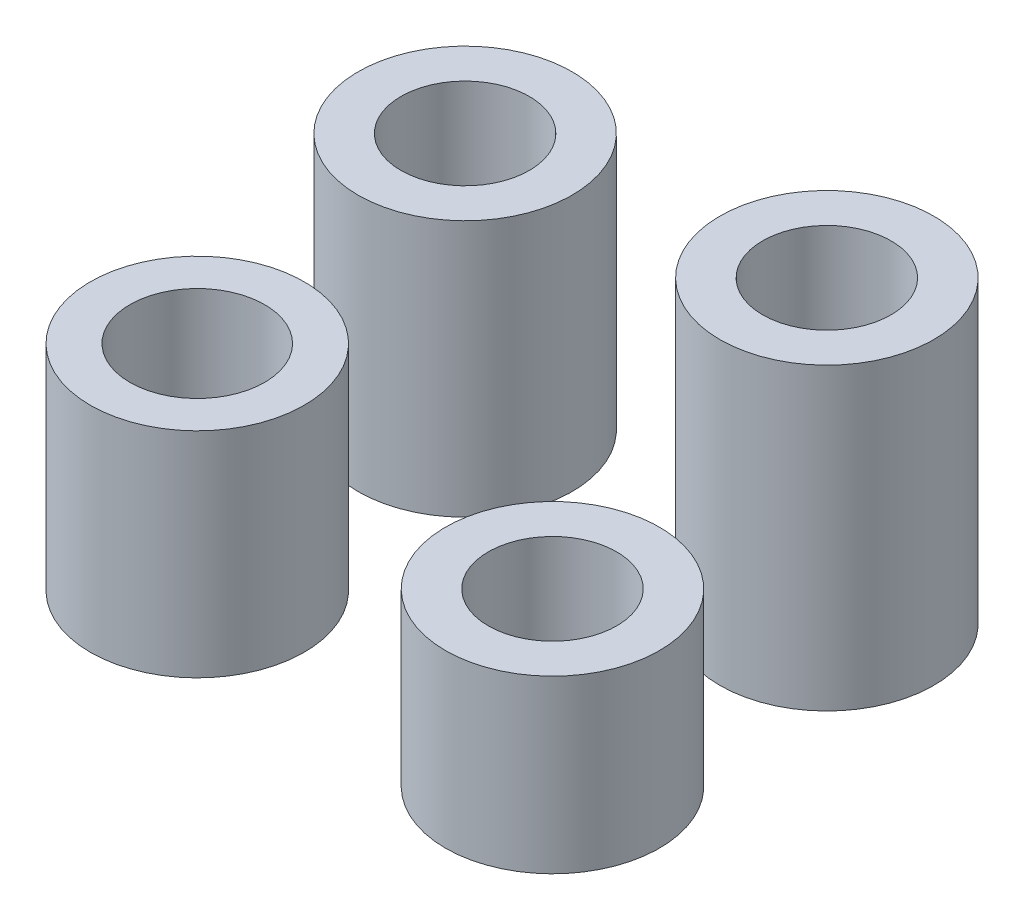
ISO-10303-21;
HEADER;
FILE_DESCRIPTION(('STEP AP214'),'2;1');
FILE_NAME('part.step','',(''),(''),'','','');
FILE_SCHEMA(('AUTOMOTIVE_DESIGN { 1 0 10303 214 1 1 1 1 }'));
ENDSEC;
DATA;
#1=APPLICATION_CONTEXT('core data for automotive mechanical design processes');
#2=APPLICATION_PROTOCOL_DEFINITION('international standard','automotive_design',2000,#1);
#3=PRODUCT_CONTEXT('',#1,'mechanical');
#4=PRODUCT('Part','Part','',(#3));
#5=PRODUCT_RELATED_PRODUCT_CATEGORY('part','',(#4));
#6=PRODUCT_DEFINITION_FORMATION('','',#4);
#7=PRODUCT_DEFINITION_CONTEXT('part definition',#1,'design');
#8=PRODUCT_DEFINITION('design','',#6,#7);
#9=PRODUCT_DEFINITION_SHAPE('','',#8);
#10=(LENGTH_UNIT() NAMED_UNIT(*) SI_UNIT(.MILLI.,.METRE.));
#11=(NAMED_UNIT(*) PLANE_ANGLE_UNIT() SI_UNIT($,.RADIAN.));
#12=(NAMED_UNIT(*) SI_UNIT($,.STERADIAN.) SOLID_ANGLE_UNIT());
#13=UNCERTAINTY_MEASURE_WITH_UNIT(LENGTH_MEASURE(1.E-05),#10,'distance_accuracy_value','');
#14=(GEOMETRIC_REPRESENTATION_CONTEXT(3) GLOBAL_UNCERTAINTY_ASSIGNED_CONTEXT((#13)) GLOBAL_UNIT_ASSIGNED_CONTEXT((#10,
#11,#12)) REPRESENTATION_CONTEXT('',''));
#15=CARTESIAN_POINT('',(0.,0.,0.));
#16=DIRECTION('',(0.,0.,1.));
#17=DIRECTION('',(1.,0.,0.));
#18=AXIS2_PLACEMENT_3D('',#15,#16,#17);
#19=CARTESIAN_POINT('',(-35.5420297362253,7.,-16.1029157368302));
#20=DIRECTION('',(0.,1.,0.));
#21=DIRECTION('',(0.,0.,1.));
#22=AXIS2_PLACEMENT_3D('',#19,#20,#21);
#23=PLANE('',#22);
#24=CARTESIAN_POINT('',(-35.5420297362253,7.,-16.1029157368302));
#25=DIRECTION('',(0.,1.,0.));
#26=DIRECTION('',(0.,0.,1.));
#27=AXIS2_PLACEMENT_3D('',#24,#25,#26);
#28=CIRCLE('',#27,2.5);
#29=CARTESIAN_POINT('',(-35.5420297362253,7.,-13.6029157368302));
#30=VERTEX_POINT('',#29);
#31=EDGE_CURVE('E11',#30,#30,#28,.T.);
#32=ORIENTED_EDGE('',*,*,#31,.T.);
#33=EDGE_LOOP('',(#32));
#34=FACE_BOUND('',#33,.T.);
#35=CARTESIAN_POINT('',(-35.5420297362253,7.,-16.1029157368302));
#36=DIRECTION('',(0.,1.,0.));
#37=DIRECTION('',(0.,0.,1.));
#38=AXIS2_PLACEMENT_3D('',#35,#36,#37);
#39=CIRCLE('',#38,1.5);
#40=CARTESIAN_POINT('',(-35.5420297362253,7.,-14.6029157368302));
#41=VERTEX_POINT('',#40);
#42=EDGE_CURVE('E61',#41,#41,#39,.T.);
#43=ORIENTED_EDGE('',*,*,#42,.F.);
#44=EDGE_LOOP('',(#43));
#45=FACE_BOUND('',#44,.T.);
#46=ADVANCED_FACE('F48',(#34,#45),#23,.T.);
#47=CARTESIAN_POINT('',(-35.5420297362253,0.,-16.1029157368302));
#48=DIRECTION('',(0.,1.,0.));
#49=DIRECTION('',(0.,0.,1.));
#50=AXIS2_PLACEMENT_3D('',#47,#48,#49);
#51=PLANE('',#50);
#52=CARTESIAN_POINT('',(-35.5420297362253,0.,-16.1029157368302));
#53=DIRECTION('',(0.,1.,0.));
#54=DIRECTION('',(0.,0.,1.));
#55=AXIS2_PLACEMENT_3D('',#52,#53,#54);
#56=CIRCLE('',#55,2.5);
#57=CARTESIAN_POINT('',(-35.5420297362253,0.,-13.6029157368302));
#58=VERTEX_POINT('',#57);
#59=EDGE_CURVE('E52',#58,#58,#56,.T.);
#60=ORIENTED_EDGE('',*,*,#59,.F.);
#61=EDGE_LOOP('',(#60));
#62=FACE_BOUND('',#61,.T.);
#63=CARTESIAN_POINT('',(-35.5420297362253,0.,-16.1029157368302));
#64=DIRECTION('',(0.,1.,0.));
#65=DIRECTION('',(0.,0.,1.));
#66=AXIS2_PLACEMENT_3D('',#63,#64,#65);
#67=CIRCLE('',#66,1.5);
#68=CARTESIAN_POINT('',(-35.5420297362253,0.,-14.6029157368302));
#69=VERTEX_POINT('',#68);
#70=EDGE_CURVE('E63',#69,#69,#67,.T.);
#71=ORIENTED_EDGE('',*,*,#70,.T.);
#72=EDGE_LOOP('',(#71));
#73=FACE_BOUND('',#72,.T.);
#74=ADVANCED_FACE('F75',(#62,#73),#51,.F.);
#75=CARTESIAN_POINT('',(-35.5420297362253,7.,-16.1029157368302));
#76=DIRECTION('',(0.,-1.,0.));
#77=DIRECTION('',(0.,0.,-1.));
#78=AXIS2_PLACEMENT_3D('',#75,#76,#77);
#79=CYLINDRICAL_SURFACE('',#78,2.5);
#80=ORIENTED_EDGE('',*,*,#31,.F.);
#81=EDGE_LOOP('',(#80));
#82=FACE_BOUND('',#81,.T.);
#83=ORIENTED_EDGE('',*,*,#59,.T.);
#84=EDGE_LOOP('',(#83));
#85=FACE_BOUND('',#84,.T.);
#86=ADVANCED_FACE('F50',(#82,#85),#79,.T.);
#87=CARTESIAN_POINT('',(-35.5420297362253,7.,-16.1029157368302));
#88=DIRECTION('',(0.,-1.,0.));
#89=DIRECTION('',(0.,0.,-1.));
#90=AXIS2_PLACEMENT_3D('',#87,#88,#89);
#91=CYLINDRICAL_SURFACE('',#90,1.5);
#92=ORIENTED_EDGE('',*,*,#42,.T.);
#93=EDGE_LOOP('',(#92));
#94=FACE_BOUND('',#93,.T.);
#95=ORIENTED_EDGE('',*,*,#70,.F.);
#96=EDGE_LOOP('',(#95));
#97=FACE_BOUND('',#96,.T.);
#98=ADVANCED_FACE('F71',(#94,#97),#91,.F.);
#99=CLOSED_SHELL('',(#46,#74,#86,#98));
#100=MANIFOLD_SOLID_BREP('B2',#99);
#101=CARTESIAN_POINT('',(-43.6910371403717,6.,-15.7984987935719));
#102=DIRECTION('',(0.,1.,0.));
#103=DIRECTION('',(0.,0.,1.));
#104=AXIS2_PLACEMENT_3D('',#101,#102,#103);
#105=PLANE('',#104);
#106=CARTESIAN_POINT('',(-43.6910371403717,6.,-15.7984987935719));
#107=DIRECTION('',(0.,1.,0.));
#108=DIRECTION('',(0.,0.,1.));
#109=AXIS2_PLACEMENT_3D('',#106,#107,#108);
#110=CIRCLE('',#109,2.5);
#111=CARTESIAN_POINT('',(-43.6910371403717,6.,-13.2984987935719));
#112=VERTEX_POINT('',#111);
#113=EDGE_CURVE('E47',#112,#112,#110,.T.);
#114=ORIENTED_EDGE('',*,*,#113,.T.);
#115=EDGE_LOOP('',(#114));
#116=FACE_BOUND('',#115,.T.);
#117=CARTESIAN_POINT('',(-43.6910371403717,6.,-15.7984987935719));
#118=DIRECTION('',(0.,1.,0.));
#119=DIRECTION('',(0.,0.,1.));
#120=AXIS2_PLACEMENT_3D('',#117,#118,#119);
#121=CIRCLE('',#120,1.5);
#122=CARTESIAN_POINT('',(-43.6910371403717,6.,-14.2984987935719));
#123=VERTEX_POINT('',#122);
#124=EDGE_CURVE('E133',#123,#123,#121,.T.);
#125=ORIENTED_EDGE('',*,*,#124,.F.);
#126=EDGE_LOOP('',(#125));
#127=FACE_BOUND('',#126,.T.);
#128=ADVANCED_FACE('F122',(#116,#127),#105,.T.);
#129=CARTESIAN_POINT('',(-43.6910371403717,0.,-15.7984987935719));
#130=DIRECTION('',(0.,1.,0.));
#131=DIRECTION('',(0.,0.,1.));
#132=AXIS2_PLACEMENT_3D('',#129,#130,#131);
#133=PLANE('',#132);
#134=CARTESIAN_POINT('',(-43.6910371403717,0.,-15.7984987935719));
#135=DIRECTION('',(0.,1.,0.));
#136=DIRECTION('',(0.,0.,1.));
#137=AXIS2_PLACEMENT_3D('',#134,#135,#136);
#138=CIRCLE('',#137,2.5);
#139=CARTESIAN_POINT('',(-43.6910371403717,0.,-13.2984987935719));
#140=VERTEX_POINT('',#139);
#141=EDGE_CURVE('E126',#140,#140,#138,.T.);
#142=ORIENTED_EDGE('',*,*,#141,.F.);
#143=EDGE_LOOP('',(#142));
#144=FACE_BOUND('',#143,.T.);
#145=CARTESIAN_POINT('',(-43.6910371403717,0.,-15.7984987935719));
#146=DIRECTION('',(0.,1.,0.));
#147=DIRECTION('',(0.,0.,1.));
#148=AXIS2_PLACEMENT_3D('',#145,#146,#147);
#149=CIRCLE('',#148,1.5);
#150=CARTESIAN_POINT('',(-43.6910371403717,0.,-14.2984987935719));
#151=VERTEX_POINT('',#150);
#152=EDGE_CURVE('E135',#151,#151,#149,.T.);
#153=ORIENTED_EDGE('',*,*,#152,.T.);
#154=EDGE_LOOP('',(#153));
#155=FACE_BOUND('',#154,.T.);
#156=ADVANCED_FACE('F145',(#144,#155),#133,.F.);
#157=CARTESIAN_POINT('',(-43.6910371403717,6.,-15.7984987935719));
#158=DIRECTION('',(0.,-1.,0.));
#159=DIRECTION('',(0.,0.,-1.));
#160=AXIS2_PLACEMENT_3D('',#157,#158,#159);
#161=CYLINDRICAL_SURFACE('',#160,2.5);
#162=ORIENTED_EDGE('',*,*,#113,.F.);
#163=EDGE_LOOP('',(#162));
#164=FACE_BOUND('',#163,.T.);
#165=ORIENTED_EDGE('',*,*,#141,.T.);
#166=EDGE_LOOP('',(#165));
#167=FACE_BOUND('',#166,.T.);
#168=ADVANCED_FACE('F124',(#164,#167),#161,.T.);
#169=CARTESIAN_POINT('',(-43.6910371403717,6.,-15.7984987935719));
#170=DIRECTION('',(0.,-1.,0.));
#171=DIRECTION('',(0.,0.,-1.));
#172=AXIS2_PLACEMENT_3D('',#169,#170,#171);
#173=CYLINDRICAL_SURFACE('',#172,1.5);
#174=ORIENTED_EDGE('',*,*,#124,.T.);
#175=EDGE_LOOP('',(#174));
#176=FACE_BOUND('',#175,.T.);
#177=ORIENTED_EDGE('',*,*,#152,.F.);
#178=EDGE_LOOP('',(#177));
#179=FACE_BOUND('',#178,.T.);
#180=ADVANCED_FACE('F141',(#176,#179),#173,.F.);
#181=CLOSED_SHELL('',(#128,#156,#168,#180));
#182=MANIFOLD_SOLID_BREP('B6',#181);
#183=CARTESIAN_POINT('',(-35.4531489796288,4.,-9.60230987941647));
#184=DIRECTION('',(0.,1.,0.));
#185=DIRECTION('',(0.,0.,1.));
#186=AXIS2_PLACEMENT_3D('',#183,#184,#185);
#187=PLANE('',#186);
#188=CARTESIAN_POINT('',(-35.4531489796288,4.,-9.60230987941647));
#189=DIRECTION('',(0.,1.,0.));
#190=DIRECTION('',(0.,0.,1.));
#191=AXIS2_PLACEMENT_3D('',#188,#189,#190);
#192=CIRCLE('',#191,2.5);
#193=CARTESIAN_POINT('',(-35.4531489796288,4.,-7.10230987941647));
#194=VERTEX_POINT('',#193);
#195=EDGE_CURVE('E121',#194,#194,#192,.T.);
#196=ORIENTED_EDGE('',*,*,#195,.T.);
#197=EDGE_LOOP('',(#196));
#198=FACE_BOUND('',#197,.T.);
#199=CARTESIAN_POINT('',(-35.4531489796288,4.,-9.60230987941647));
#200=DIRECTION('',(0.,1.,0.));
#201=DIRECTION('',(0.,0.,1.));
#202=AXIS2_PLACEMENT_3D('',#199,#200,#201);
#203=CIRCLE('',#202,1.5);
#204=CARTESIAN_POINT('',(-35.4531489796288,4.,-8.10230987941647));
#205=VERTEX_POINT('',#204);
#206=EDGE_CURVE('E202',#205,#205,#203,.T.);
#207=ORIENTED_EDGE('',*,*,#206,.F.);
#208=EDGE_LOOP('',(#207));
#209=FACE_BOUND('',#208,.T.);
#210=ADVANCED_FACE('F191',(#198,#209),#187,.T.);
#211=CARTESIAN_POINT('',(-35.4531489796288,0.,-9.60230987941647));
#212=DIRECTION('',(0.,1.,0.));
#213=DIRECTION('',(0.,0.,1.));
#214=AXIS2_PLACEMENT_3D('',#211,#212,#213);
#215=PLANE('',#214);
#216=CARTESIAN_POINT('',(-35.4531489796288,0.,-9.60230987941647));
#217=DIRECTION('',(0.,1.,0.));
#218=DIRECTION('',(0.,0.,1.));
#219=AXIS2_PLACEMENT_3D('',#216,#217,#218);
#220=CIRCLE('',#219,2.5);
#221=CARTESIAN_POINT('',(-35.4531489796288,0.,-7.10230987941647));
#222=VERTEX_POINT('',#221);
#223=EDGE_CURVE('E195',#222,#222,#220,.T.);
#224=ORIENTED_EDGE('',*,*,#223,.F.);
#225=EDGE_LOOP('',(#224));
#226=FACE_BOUND('',#225,.T.);
#227=CARTESIAN_POINT('',(-35.4531489796288,0.,-9.60230987941647));
#228=DIRECTION('',(0.,1.,0.));
#229=DIRECTION('',(0.,0.,1.));
#230=AXIS2_PLACEMENT_3D('',#227,#228,#229);
#231=CIRCLE('',#230,1.5);
#232=CARTESIAN_POINT('',(-35.4531489796288,0.,-8.10230987941647));
#233=VERTEX_POINT('',#232);
#234=EDGE_CURVE('E204',#233,#233,#231,.T.);
#235=ORIENTED_EDGE('',*,*,#234,.T.);
#236=EDGE_LOOP('',(#235));
#237=FACE_BOUND('',#236,.T.);
#238=ADVANCED_FACE('F214',(#226,#237),#215,.F.);
#239=CARTESIAN_POINT('',(-35.4531489796288,4.,-9.60230987941647));
#240=DIRECTION('',(0.,-1.,0.));
#241=DIRECTION('',(0.,0.,-1.));
#242=AXIS2_PLACEMENT_3D('',#239,#240,#241);
#243=CYLINDRICAL_SURFACE('',#242,2.5);
#244=ORIENTED_EDGE('',*,*,#195,.F.);
#245=EDGE_LOOP('',(#244));
#246=FACE_BOUND('',#245,.T.);
#247=ORIENTED_EDGE('',*,*,#223,.T.);
#248=EDGE_LOOP('',(#247));
#249=FACE_BOUND('',#248,.T.);
#250=ADVANCED_FACE('F193',(#246,#249),#243,.T.);
#251=CARTESIAN_POINT('',(-35.4531489796288,4.,-9.60230987941647));
#252=DIRECTION('',(0.,-1.,0.));
#253=DIRECTION('',(0.,0.,-1.));
#254=AXIS2_PLACEMENT_3D('',#251,#252,#253);
#255=CYLINDRICAL_SURFACE('',#254,1.5);
#256=ORIENTED_EDGE('',*,*,#206,.T.);
#257=EDGE_LOOP('',(#256));
#258=FACE_BOUND('',#257,.T.);
#259=ORIENTED_EDGE('',*,*,#234,.F.);
#260=EDGE_LOOP('',(#259));
#261=FACE_BOUND('',#260,.T.);
#262=ADVANCED_FACE('F210',(#258,#261),#255,.F.);
#263=CLOSED_SHELL('',(#210,#238,#250,#262));
#264=MANIFOLD_SOLID_BREP('B42',#263);
#265=CARTESIAN_POINT('',(-43.5694080245024,5.,-9.41734836723085));
#266=DIRECTION('',(0.,-1.,0.));
#267=DIRECTION('',(0.,0.,-1.));
#268=AXIS2_PLACEMENT_3D('',#265,#266,#267);
#269=CYLINDRICAL_SURFACE('',#268,1.575);
#270=CARTESIAN_POINT('',(-43.5694080245024,5.,-9.41734836723085));
#271=DIRECTION('',(0.,1.,0.));
#272=DIRECTION('',(0.,0.,1.));
#273=AXIS2_PLACEMENT_3D('',#270,#271,#272);
#274=CIRCLE('',#273,1.575);
#275=CARTESIAN_POINT('',(-43.5694080245024,5.,-7.84234836723085));
#276=VERTEX_POINT('',#275);
#277=EDGE_CURVE('E260',#276,#276,#274,.T.);
#278=ORIENTED_EDGE('',*,*,#277,.T.);
#279=EDGE_LOOP('',(#278));
#280=FACE_BOUND('',#279,.T.);
#281=CARTESIAN_POINT('',(-43.5694080245024,0.,-9.41734836723085));
#282=DIRECTION('',(0.,1.,0.));
#283=DIRECTION('',(0.,0.,1.));
#284=AXIS2_PLACEMENT_3D('',#281,#282,#283);
#285=CIRCLE('',#284,1.575);
#286=CARTESIAN_POINT('',(-43.5694080245024,0.,-7.84234836723085));
#287=VERTEX_POINT('',#286);
#288=EDGE_CURVE('E266',#287,#287,#285,.T.);
#289=ORIENTED_EDGE('',*,*,#288,.F.);
#290=EDGE_LOOP('',(#289));
#291=FACE_BOUND('',#290,.T.);
#292=ADVANCED_FACE('F253',(#280,#291),#269,.F.);
#293=CARTESIAN_POINT('',(-43.5694080245024,5.,-9.41734836723085));
#294=DIRECTION('',(0.,-1.,0.));
#295=DIRECTION('',(0.,0.,-1.));
#296=AXIS2_PLACEMENT_3D('',#293,#294,#295);
#297=CYLINDRICAL_SURFACE('',#296,2.5);
#298=CARTESIAN_POINT('',(-43.5694080245024,5.,-9.41734836723085));
#299=DIRECTION('',(0.,1.,0.));
#300=DIRECTION('',(0.,0.,1.));
#301=AXIS2_PLACEMENT_3D('',#298,#299,#300);
#302=CIRCLE('',#301,2.5);
#303=CARTESIAN_POINT('',(-43.5694080245024,5.,-6.91734836723085));
#304=VERTEX_POINT('',#303);
#305=EDGE_CURVE('E190',#304,#304,#302,.T.);
#306=ORIENTED_EDGE('',*,*,#305,.F.);
#307=EDGE_LOOP('',(#306));
#308=FACE_BOUND('',#307,.T.);
#309=CARTESIAN_POINT('',(-43.5694080245024,0.,-9.41734836723085));
#310=DIRECTION('',(0.,1.,0.));
#311=DIRECTION('',(0.,0.,1.));
#312=AXIS2_PLACEMENT_3D('',#309,#310,#311);
#313=CIRCLE('',#312,2.5);
#314=CARTESIAN_POINT('',(-43.5694080245024,0.,-6.91734836723085));
#315=VERTEX_POINT('',#314);
#316=EDGE_CURVE('E256',#315,#315,#313,.T.);
#317=ORIENTED_EDGE('',*,*,#316,.T.);
#318=EDGE_LOOP('',(#317));
#319=FACE_BOUND('',#318,.T.);
#320=ADVANCED_FACE('F273',(#308,#319),#297,.T.);
#321=CARTESIAN_POINT('',(0.,5.,0.));
#322=DIRECTION('',(0.,1.,0.));
#323=DIRECTION('',(0.,0.,1.));
#324=AXIS2_PLACEMENT_3D('',#321,#322,#323);
#325=PLANE('',#324);
#326=ORIENTED_EDGE('',*,*,#277,.F.);
#327=EDGE_LOOP('',(#326));
#328=FACE_BOUND('',#327,.T.);
#329=ORIENTED_EDGE('',*,*,#305,.T.);
#330=EDGE_LOOP('',(#329));
#331=FACE_BOUND('',#330,.T.);
#332=ADVANCED_FACE('F277',(#328,#331),#325,.T.);
#333=CARTESIAN_POINT('',(0.,0.,0.));
#334=DIRECTION('',(0.,1.,0.));
#335=DIRECTION('',(0.,0.,1.));
#336=AXIS2_PLACEMENT_3D('',#333,#334,#335);
#337=PLANE('',#336);
#338=ORIENTED_EDGE('',*,*,#288,.T.);
#339=EDGE_LOOP('',(#338));
#340=FACE_BOUND('',#339,.T.);
#341=ORIENTED_EDGE('',*,*,#316,.F.);
#342=EDGE_LOOP('',(#341));
#343=FACE_BOUND('',#342,.T.);
#344=ADVANCED_FACE('F275',(#340,#343),#337,.F.);
#345=CLOSED_SHELL('',(#292,#320,#332,#344));
#346=MANIFOLD_SOLID_BREP('B116',#345);
#347=ADVANCED_BREP_SHAPE_REPRESENTATION('',(#18,#100,#182,#264,#346),#14);
#348=SHAPE_DEFINITION_REPRESENTATION(#9,#347);
ENDSEC;
END-ISO-10303-21;
